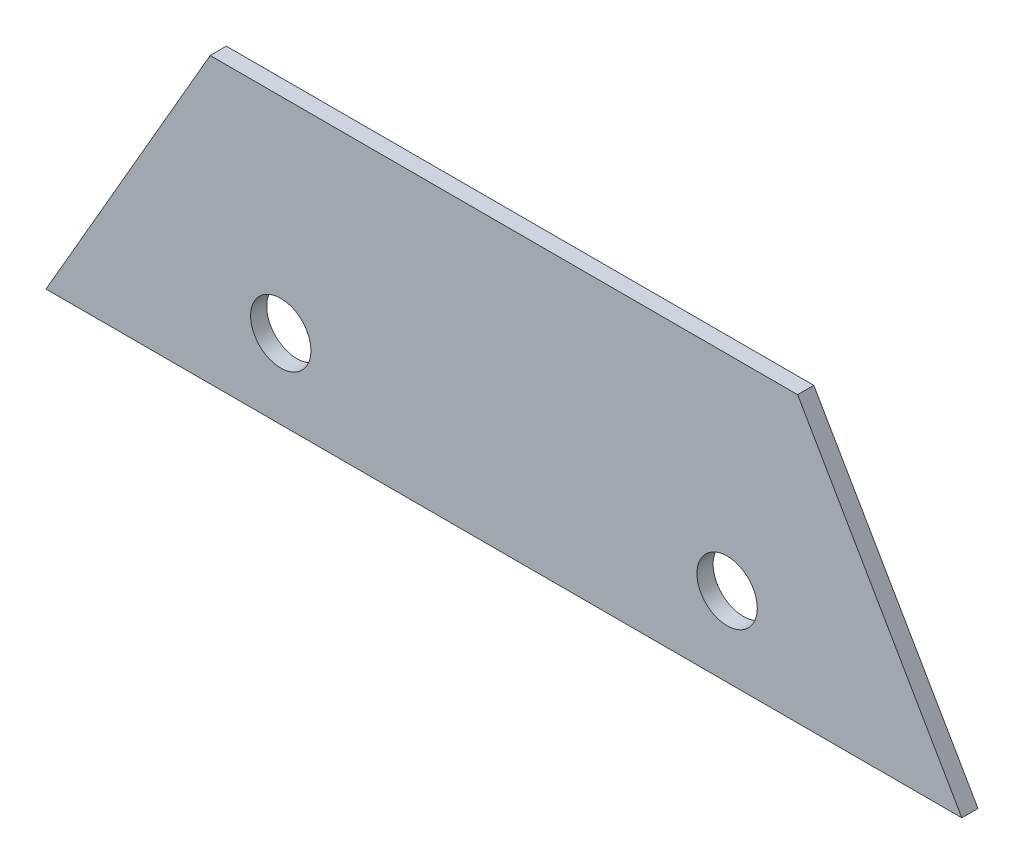
ISO-10303-21;
HEADER;
FILE_DESCRIPTION(('STEP AP214'),'2;1');
FILE_NAME('part.step','',(''),(''),'','','');
FILE_SCHEMA(('AUTOMOTIVE_DESIGN { 1 0 10303 214 1 1 1 1 }'));
ENDSEC;
DATA;
#1=APPLICATION_CONTEXT('core data for automotive mechanical design processes');
#2=APPLICATION_PROTOCOL_DEFINITION('international standard','automotive_design',2000,#1);
#3=PRODUCT_CONTEXT('',#1,'mechanical');
#4=PRODUCT('Part','Part','',(#3));
#5=PRODUCT_RELATED_PRODUCT_CATEGORY('part','',(#4));
#6=PRODUCT_DEFINITION_FORMATION('','',#4);
#7=PRODUCT_DEFINITION_CONTEXT('part definition',#1,'design');
#8=PRODUCT_DEFINITION('design','',#6,#7);
#9=PRODUCT_DEFINITION_SHAPE('','',#8);
#10=(LENGTH_UNIT() NAMED_UNIT(*) SI_UNIT(.MILLI.,.METRE.));
#11=(NAMED_UNIT(*) PLANE_ANGLE_UNIT() SI_UNIT($,.RADIAN.));
#12=(NAMED_UNIT(*) SI_UNIT($,.STERADIAN.) SOLID_ANGLE_UNIT());
#13=UNCERTAINTY_MEASURE_WITH_UNIT(LENGTH_MEASURE(1.E-05),#10,'distance_accuracy_value','');
#14=(GEOMETRIC_REPRESENTATION_CONTEXT(3) GLOBAL_UNCERTAINTY_ASSIGNED_CONTEXT((#13)) GLOBAL_UNIT_ASSIGNED_CONTEXT((#10,
#11,#12)) REPRESENTATION_CONTEXT('',''));
#15=CARTESIAN_POINT('',(0.,0.,0.));
#16=DIRECTION('',(0.,0.,1.));
#17=DIRECTION('',(1.,0.,0.));
#18=AXIS2_PLACEMENT_3D('',#15,#16,#17);
#19=CARTESIAN_POINT('',(0.,0.,-11.90625));
#20=DIRECTION('',(0.,0.,-1.));
#21=DIRECTION('',(0.,1.,0.));
#22=AXIS2_PLACEMENT_3D('',#19,#20,#21);
#23=PLANE('',#22);
#24=CARTESIAN_POINT('',(-164.309496882,-525.607187924995,-11.90625));
#25=DIRECTION('',(0.,0.,1.));
#26=DIRECTION('',(1.,0.,0.));
#27=AXIS2_PLACEMENT_3D('',#24,#25,#26);
#28=CIRCLE('',#27,22.225);
#29=CARTESIAN_POINT('',(-142.084496882,-525.607187924995,-11.90625));
#30=VERTEX_POINT('',#29);
#31=EDGE_CURVE('E96',#30,#30,#28,.T.);
#32=ORIENTED_EDGE('',*,*,#31,.T.);
#33=EDGE_LOOP('',(#32));
#34=FACE_BOUND('',#33,.T.);
#35=CARTESIAN_POINT('',(164.309496882,-525.607187924995,-11.90625));
#36=DIRECTION('',(0.,0.,1.));
#37=DIRECTION('',(1.,0.,0.));
#38=AXIS2_PLACEMENT_3D('',#35,#36,#37);
#39=CIRCLE('',#38,22.225);
#40=CARTESIAN_POINT('',(186.534496882,-525.607187924995,-11.90625));
#41=VERTEX_POINT('',#40);
#42=EDGE_CURVE('E114',#41,#41,#39,.T.);
#43=ORIENTED_EDGE('',*,*,#42,.T.);
#44=EDGE_LOOP('',(#43));
#45=FACE_BOUND('',#44,.T.);
#46=DIRECTION('',(1.,0.,0.));
#47=VECTOR('',#46,1.);
#48=CARTESIAN_POINT('',(337.114930678369,-583.900187924995,-11.90625));
#49=LINE('',#48,#47);
#50=CARTESIAN_POINT('',(-337.114930678359,-583.900187924995,-11.90625));
#51=VERTEX_POINT('',#50);
#52=CARTESIAN_POINT('',(337.114930678369,-583.900187924995,-11.90625));
#53=VERTEX_POINT('',#52);
#54=EDGE_CURVE('E42',#51,#53,#49,.T.);
#55=ORIENTED_EDGE('',*,*,#54,.F.);
#56=DIRECTION('',(-0.5,-0.866025403784439,0.));
#57=VECTOR('',#56,1.);
#58=CARTESIAN_POINT('',(-337.114930678359,-583.900187924995,-11.90625));
#59=LINE('',#58,#57);
#60=CARTESIAN_POINT('',(-216.238948080681,-374.536844651005,-11.90625));
#61=VERTEX_POINT('',#60);
#62=EDGE_CURVE('E65',#61,#51,#59,.T.);
#63=ORIENTED_EDGE('',*,*,#62,.F.);
#64=DIRECTION('',(-1.,0.,0.));
#65=VECTOR('',#64,1.);
#66=CARTESIAN_POINT('',(-216.238948080681,-374.536844651005,-11.90625));
#67=LINE('',#66,#65);
#68=CARTESIAN_POINT('',(216.238948080691,-374.536844651005,-11.90625));
#69=VERTEX_POINT('',#68);
#70=EDGE_CURVE('E70',#69,#61,#67,.T.);
#71=ORIENTED_EDGE('',*,*,#70,.F.);
#72=DIRECTION('',(-0.5,0.866025403784438,0.));
#73=VECTOR('',#72,1.);
#74=CARTESIAN_POINT('',(216.238948080691,-374.536844651005,-11.90625));
#75=LINE('',#74,#73);
#76=EDGE_CURVE('E85',#53,#69,#75,.T.);
#77=ORIENTED_EDGE('',*,*,#76,.F.);
#78=EDGE_LOOP('',(#55,#63,#71,#77));
#79=FACE_BOUND('',#78,.T.);
#80=ADVANCED_FACE('F34',(#34,#45,#79),#23,.T.);
#81=CARTESIAN_POINT('',(0.,0.,0.));
#82=DIRECTION('',(0.,0.,-1.));
#83=DIRECTION('',(-1.,0.,0.));
#84=AXIS2_PLACEMENT_3D('',#81,#82,#83);
#85=PLANE('',#84);
#86=CARTESIAN_POINT('',(-164.309496882,-525.607187924995,0.));
#87=DIRECTION('',(0.,0.,1.));
#88=DIRECTION('',(1.,0.,0.));
#89=AXIS2_PLACEMENT_3D('',#86,#87,#88);
#90=CIRCLE('',#89,22.225);
#91=CARTESIAN_POINT('',(-142.084496882,-525.607187924995,0.));
#92=VERTEX_POINT('',#91);
#93=EDGE_CURVE('E117',#92,#92,#90,.T.);
#94=ORIENTED_EDGE('',*,*,#93,.F.);
#95=EDGE_LOOP('',(#94));
#96=FACE_BOUND('',#95,.T.);
#97=CARTESIAN_POINT('',(164.309496882,-525.607187924995,0.));
#98=DIRECTION('',(0.,0.,1.));
#99=DIRECTION('',(1.,0.,0.));
#100=AXIS2_PLACEMENT_3D('',#97,#98,#99);
#101=CIRCLE('',#100,22.225);
#102=CARTESIAN_POINT('',(186.534496882,-525.607187924995,0.));
#103=VERTEX_POINT('',#102);
#104=EDGE_CURVE('E111',#103,#103,#101,.T.);
#105=ORIENTED_EDGE('',*,*,#104,.F.);
#106=EDGE_LOOP('',(#105));
#107=FACE_BOUND('',#106,.T.);
#108=DIRECTION('',(1.,0.,0.));
#109=VECTOR('',#108,1.);
#110=CARTESIAN_POINT('',(337.114930678369,-583.900187924995,0.));
#111=LINE('',#110,#109);
#112=CARTESIAN_POINT('',(-337.114930678359,-583.900187924995,0.));
#113=VERTEX_POINT('',#112);
#114=CARTESIAN_POINT('',(337.114930678369,-583.900187924995,0.));
#115=VERTEX_POINT('',#114);
#116=EDGE_CURVE('E94',#113,#115,#111,.T.);
#117=ORIENTED_EDGE('',*,*,#116,.T.);
#118=DIRECTION('',(-0.5,0.866025403784438,0.));
#119=VECTOR('',#118,1.);
#120=CARTESIAN_POINT('',(216.238948080691,-374.536844651005,0.));
#121=LINE('',#120,#119);
#122=CARTESIAN_POINT('',(216.238948080691,-374.536844651005,0.));
#123=VERTEX_POINT('',#122);
#124=EDGE_CURVE('E83',#115,#123,#121,.T.);
#125=ORIENTED_EDGE('',*,*,#124,.T.);
#126=DIRECTION('',(-1.,0.,0.));
#127=VECTOR('',#126,1.);
#128=CARTESIAN_POINT('',(-216.238948080681,-374.536844651005,0.));
#129=LINE('',#128,#127);
#130=CARTESIAN_POINT('',(-216.238948080681,-374.536844651005,0.));
#131=VERTEX_POINT('',#130);
#132=EDGE_CURVE('E86',#123,#131,#129,.T.);
#133=ORIENTED_EDGE('',*,*,#132,.T.);
#134=DIRECTION('',(-0.5,-0.866025403784439,0.));
#135=VECTOR('',#134,1.);
#136=CARTESIAN_POINT('',(-337.114930678359,-583.900187924995,0.));
#137=LINE('',#136,#135);
#138=EDGE_CURVE('E91',#131,#113,#137,.T.);
#139=ORIENTED_EDGE('',*,*,#138,.T.);
#140=EDGE_LOOP('',(#117,#125,#133,#139));
#141=FACE_BOUND('',#140,.T.);
#142=ADVANCED_FACE('F93',(#96,#107,#141),#85,.F.);
#143=CARTESIAN_POINT('',(216.238948080691,-374.536844651005,-717.894150358055));
#144=DIRECTION('',(0.866025403784438,0.5,0.));
#145=DIRECTION('',(-0.5,0.866025403784438,0.));
#146=AXIS2_PLACEMENT_3D('',#143,#144,#145);
#147=PLANE('',#146);
#148=DIRECTION('',(0.,0.,1.));
#149=VECTOR('',#148,1.);
#150=CARTESIAN_POINT('',(337.114930678369,-583.900187924995,-717.894150358055));
#151=LINE('',#150,#149);
#152=EDGE_CURVE('E11',#53,#115,#151,.T.);
#153=ORIENTED_EDGE('',*,*,#152,.F.);
#154=ORIENTED_EDGE('',*,*,#76,.T.);
#155=DIRECTION('',(0.,0.,1.));
#156=VECTOR('',#155,1.);
#157=CARTESIAN_POINT('',(216.238948080691,-374.536844651005,-717.894150358055));
#158=LINE('',#157,#156);
#159=EDGE_CURVE('E80',#69,#123,#158,.T.);
#160=ORIENTED_EDGE('',*,*,#159,.T.);
#161=ORIENTED_EDGE('',*,*,#124,.F.);
#162=EDGE_LOOP('',(#153,#154,#160,#161));
#163=FACE_BOUND('',#162,.T.);
#164=ADVANCED_FACE('F81',(#163),#147,.T.);
#165=CARTESIAN_POINT('',(-216.238948080681,-374.536844651005,-717.894150358055));
#166=DIRECTION('',(0.,1.,0.));
#167=DIRECTION('',(-1.,0.,0.));
#168=AXIS2_PLACEMENT_3D('',#165,#166,#167);
#169=PLANE('',#168);
#170=ORIENTED_EDGE('',*,*,#159,.F.);
#171=ORIENTED_EDGE('',*,*,#70,.T.);
#172=DIRECTION('',(0.,0.,1.));
#173=VECTOR('',#172,1.);
#174=CARTESIAN_POINT('',(-216.238948080681,-374.536844651005,-717.894150358055));
#175=LINE('',#174,#173);
#176=EDGE_CURVE('E75',#61,#131,#175,.T.);
#177=ORIENTED_EDGE('',*,*,#176,.T.);
#178=ORIENTED_EDGE('',*,*,#132,.F.);
#179=EDGE_LOOP('',(#170,#171,#177,#178));
#180=FACE_BOUND('',#179,.T.);
#181=ADVANCED_FACE('F87',(#180),#169,.T.);
#182=CARTESIAN_POINT('',(-337.114930678359,-583.900187924995,-717.894150358055));
#183=DIRECTION('',(-0.866025403784439,0.5,0.));
#184=DIRECTION('',(-0.5,-0.866025403784439,0.));
#185=AXIS2_PLACEMENT_3D('',#182,#183,#184);
#186=PLANE('',#185);
#187=ORIENTED_EDGE('',*,*,#176,.F.);
#188=ORIENTED_EDGE('',*,*,#62,.T.);
#189=DIRECTION('',(0.,0.,1.));
#190=VECTOR('',#189,1.);
#191=CARTESIAN_POINT('',(-337.114930678359,-583.900187924995,-717.894150358055));
#192=LINE('',#191,#190);
#193=EDGE_CURVE('E102',#51,#113,#192,.T.);
#194=ORIENTED_EDGE('',*,*,#193,.T.);
#195=ORIENTED_EDGE('',*,*,#138,.F.);
#196=EDGE_LOOP('',(#187,#188,#194,#195));
#197=FACE_BOUND('',#196,.T.);
#198=ADVANCED_FACE('F108',(#197),#186,.T.);
#199=CARTESIAN_POINT('',(337.114930678369,-583.900187924995,-717.894150358055));
#200=DIRECTION('',(0.,-1.,0.));
#201=DIRECTION('',(1.,0.,0.));
#202=AXIS2_PLACEMENT_3D('',#199,#200,#201);
#203=PLANE('',#202);
#204=ORIENTED_EDGE('',*,*,#193,.F.);
#205=ORIENTED_EDGE('',*,*,#54,.T.);
#206=ORIENTED_EDGE('',*,*,#152,.T.);
#207=ORIENTED_EDGE('',*,*,#116,.F.);
#208=EDGE_LOOP('',(#204,#205,#206,#207));
#209=FACE_BOUND('',#208,.T.);
#210=ADVANCED_FACE('F109',(#209),#203,.T.);
#211=CARTESIAN_POINT('',(164.309496882,-525.607187924995,-11.90625));
#212=DIRECTION('',(0.,0.,1.));
#213=DIRECTION('',(1.,0.,0.));
#214=AXIS2_PLACEMENT_3D('',#211,#212,#213);
#215=CYLINDRICAL_SURFACE('',#214,22.225);
#216=ORIENTED_EDGE('',*,*,#42,.F.);
#217=EDGE_LOOP('',(#216));
#218=FACE_BOUND('',#217,.T.);
#219=ORIENTED_EDGE('',*,*,#104,.T.);
#220=EDGE_LOOP('',(#219));
#221=FACE_BOUND('',#220,.T.);
#222=ADVANCED_FACE('F128',(#218,#221),#215,.F.);
#223=CARTESIAN_POINT('',(-164.309496882,-525.607187924995,-11.90625));
#224=DIRECTION('',(0.,0.,1.));
#225=DIRECTION('',(1.,0.,0.));
#226=AXIS2_PLACEMENT_3D('',#223,#224,#225);
#227=CYLINDRICAL_SURFACE('',#226,22.225);
#228=ORIENTED_EDGE('',*,*,#31,.F.);
#229=EDGE_LOOP('',(#228));
#230=FACE_BOUND('',#229,.T.);
#231=ORIENTED_EDGE('',*,*,#93,.T.);
#232=EDGE_LOOP('',(#231));
#233=FACE_BOUND('',#232,.T.);
#234=ADVANCED_FACE('F125',(#230,#233),#227,.F.);
#235=CLOSED_SHELL('',(#80,#142,#164,#181,#198,#210,#222,#234));
#236=MANIFOLD_SOLID_BREP('B2',#235);
#237=ADVANCED_BREP_SHAPE_REPRESENTATION('',(#18,#236),#14);
#238=SHAPE_DEFINITION_REPRESENTATION(#9,#237);
ENDSEC;
END-ISO-10303-21;
